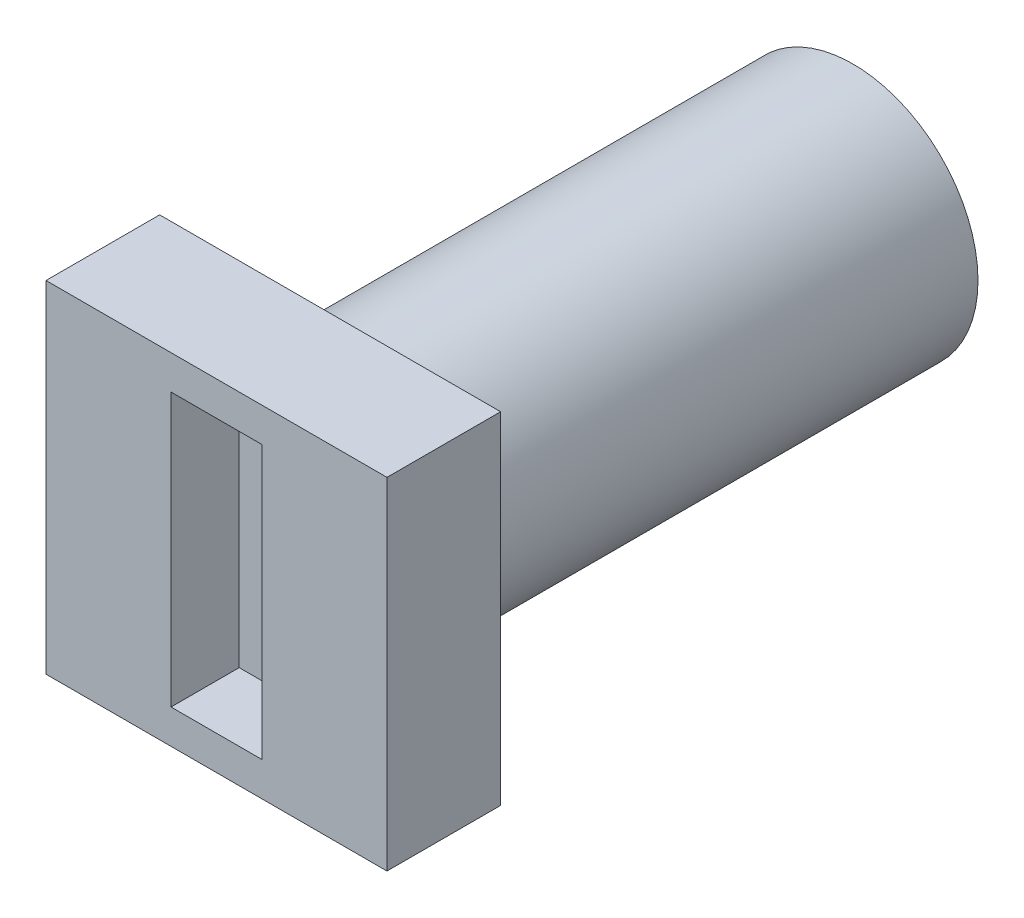
ISO-10303-21;
HEADER;
FILE_DESCRIPTION(('STEP AP214'),'2;1');
FILE_NAME('part.step','',(''),(''),'','','');
FILE_SCHEMA(('AUTOMOTIVE_DESIGN { 1 0 10303 214 1 1 1 1 }'));
ENDSEC;
DATA;
#1=APPLICATION_CONTEXT('core data for automotive mechanical design processes');
#2=APPLICATION_PROTOCOL_DEFINITION('international standard','automotive_design',2000,#1);
#3=PRODUCT_CONTEXT('',#1,'mechanical');
#4=PRODUCT('Part','Part','',(#3));
#5=PRODUCT_RELATED_PRODUCT_CATEGORY('part','',(#4));
#6=PRODUCT_DEFINITION_FORMATION('','',#4);
#7=PRODUCT_DEFINITION_CONTEXT('part definition',#1,'design');
#8=PRODUCT_DEFINITION('design','',#6,#7);
#9=PRODUCT_DEFINITION_SHAPE('','',#8);
#10=(LENGTH_UNIT() NAMED_UNIT(*) SI_UNIT(.MILLI.,.METRE.));
#11=(NAMED_UNIT(*) PLANE_ANGLE_UNIT() SI_UNIT($,.RADIAN.));
#12=(NAMED_UNIT(*) SI_UNIT($,.STERADIAN.) SOLID_ANGLE_UNIT());
#13=UNCERTAINTY_MEASURE_WITH_UNIT(LENGTH_MEASURE(1.E-05),#10,'distance_accuracy_value','');
#14=(GEOMETRIC_REPRESENTATION_CONTEXT(3) GLOBAL_UNCERTAINTY_ASSIGNED_CONTEXT((#13)) GLOBAL_UNIT_ASSIGNED_CONTEXT((#10,
#11,#12)) REPRESENTATION_CONTEXT('',''));
#15=CARTESIAN_POINT('',(0.,0.,0.));
#16=DIRECTION('',(0.,0.,1.));
#17=DIRECTION('',(1.,0.,0.));
#18=AXIS2_PLACEMENT_3D('',#15,#16,#17);
#19=CARTESIAN_POINT('',(0.,0.,0.));
#20=DIRECTION('',(0.,0.,-1.));
#21=DIRECTION('',(-1.,0.,0.));
#22=AXIS2_PLACEMENT_3D('',#19,#20,#21);
#23=PLANE('',#22);
#24=CARTESIAN_POINT('',(0.,0.,0.));
#25=DIRECTION('',(0.,0.,1.));
#26=DIRECTION('',(-1.,0.,0.));
#27=AXIS2_PLACEMENT_3D('',#24,#25,#26);
#28=CIRCLE('',#27,5.5);
#29=CARTESIAN_POINT('',(-5.,-2.29128784747792,0.));
#30=VERTEX_POINT('',#29);
#31=CARTESIAN_POINT('',(-5.,2.29128784747792,0.));
#32=VERTEX_POINT('',#31);
#33=EDGE_CURVE('E220',#30,#32,#28,.T.);
#34=ORIENTED_EDGE('',*,*,#33,.F.);
#35=DIRECTION('',(0.,-1.,0.));
#36=VECTOR('',#35,1.);
#37=CARTESIAN_POINT('',(-5.,2.29128784747792,0.));
#38=LINE('',#37,#36);
#39=EDGE_CURVE('E225',#32,#30,#38,.T.);
#40=ORIENTED_EDGE('',*,*,#39,.F.);
#41=EDGE_LOOP('',(#34,#40));
#42=FACE_BOUND('',#41,.T.);
#43=DIRECTION('',(0.,-1.,0.));
#44=VECTOR('',#43,1.);
#45=CARTESIAN_POINT('',(-2.,1.5,0.));
#46=LINE('',#45,#44);
#47=CARTESIAN_POINT('',(-2.,1.5,0.));
#48=VERTEX_POINT('',#47);
#49=CARTESIAN_POINT('',(-2.,-1.5,0.));
#50=VERTEX_POINT('',#49);
#51=EDGE_CURVE('E207',#48,#50,#46,.T.);
#52=ORIENTED_EDGE('',*,*,#51,.T.);
#53=CARTESIAN_POINT('',(0.,0.,0.));
#54=DIRECTION('',(0.,0.,1.));
#55=DIRECTION('',(-1.,0.,0.));
#56=AXIS2_PLACEMENT_3D('',#53,#54,#55);
#57=CIRCLE('',#56,2.5);
#58=EDGE_CURVE('E202',#50,#48,#57,.T.);
#59=ORIENTED_EDGE('',*,*,#58,.T.);
#60=EDGE_LOOP('',(#52,#59));
#61=FACE_BOUND('',#60,.T.);
#62=ADVANCED_FACE('F33',(#42,#61),#23,.T.);
#63=CARTESIAN_POINT('',(0.,0.,23.));
#64=DIRECTION('',(0.,0.,-1.));
#65=DIRECTION('',(-1.,0.,0.));
#66=AXIS2_PLACEMENT_3D('',#63,#64,#65);
#67=CYLINDRICAL_SURFACE('',#66,5.5);
#68=ORIENTED_EDGE('',*,*,#33,.T.);
#69=DIRECTION('',(0.,0.,-1.));
#70=VECTOR('',#69,1.);
#71=CARTESIAN_POINT('',(-5.,2.29128784747792,23.));
#72=LINE('',#71,#70);
#73=CARTESIAN_POINT('',(-5.,2.29128784747792,23.));
#74=VERTEX_POINT('',#73);
#75=EDGE_CURVE('E11',#74,#32,#72,.T.);
#76=ORIENTED_EDGE('',*,*,#75,.F.);
#77=CARTESIAN_POINT('',(0.,0.,23.));
#78=DIRECTION('',(0.,0.,1.));
#79=DIRECTION('',(-1.,0.,0.));
#80=AXIS2_PLACEMENT_3D('',#77,#78,#79);
#81=CIRCLE('',#80,5.5);
#82=CARTESIAN_POINT('',(-5.,-2.29128784747792,23.));
#83=VERTEX_POINT('',#82);
#84=EDGE_CURVE('E221',#83,#74,#81,.T.);
#85=ORIENTED_EDGE('',*,*,#84,.F.);
#86=DIRECTION('',(0.,0.,-1.));
#87=VECTOR('',#86,1.);
#88=CARTESIAN_POINT('',(-5.,-2.29128784747792,23.));
#89=LINE('',#88,#87);
#90=EDGE_CURVE('E41',#83,#30,#89,.T.);
#91=ORIENTED_EDGE('',*,*,#90,.T.);
#92=EDGE_LOOP('',(#68,#76,#85,#91));
#93=FACE_BOUND('',#92,.T.);
#94=ADVANCED_FACE('F35',(#93),#67,.T.);
#95=CARTESIAN_POINT('',(-5.,2.29128784747792,23.));
#96=DIRECTION('',(1.,0.,0.));
#97=DIRECTION('',(0.,0.,-1.));
#98=AXIS2_PLACEMENT_3D('',#95,#96,#97);
#99=PLANE('',#98);
#100=CARTESIAN_POINT('',(-5.,-0.00128784747791726,3.5));
#101=DIRECTION('',(-1.,0.,0.));
#102=DIRECTION('',(0.,0.,1.));
#103=AXIS2_PLACEMENT_3D('',#100,#101,#102);
#104=CIRCLE('',#103,1.);
#105=CARTESIAN_POINT('',(-5.,-0.00128784747791726,4.5));
#106=VERTEX_POINT('',#105);
#107=EDGE_CURVE('E190',#106,#106,#104,.T.);
#108=ORIENTED_EDGE('',*,*,#107,.F.);
#109=EDGE_LOOP('',(#108));
#110=FACE_BOUND('',#109,.T.);
#111=CARTESIAN_POINT('',(-5.,-0.00128784747791726,11.5));
#112=DIRECTION('',(-1.,0.,0.));
#113=DIRECTION('',(0.,0.,1.));
#114=AXIS2_PLACEMENT_3D('',#111,#112,#113);
#115=CIRCLE('',#114,1.);
#116=CARTESIAN_POINT('',(-5.,-0.00128784747791726,12.5));
#117=VERTEX_POINT('',#116);
#118=EDGE_CURVE('E196',#117,#117,#115,.T.);
#119=ORIENTED_EDGE('',*,*,#118,.F.);
#120=EDGE_LOOP('',(#119));
#121=FACE_BOUND('',#120,.T.);
#122=ORIENTED_EDGE('',*,*,#39,.T.);
#123=ORIENTED_EDGE('',*,*,#90,.F.);
#124=DIRECTION('',(0.,-1.,0.));
#125=VECTOR('',#124,1.);
#126=CARTESIAN_POINT('',(-5.,2.29128784747792,23.));
#127=LINE('',#126,#125);
#128=EDGE_CURVE('E224',#74,#83,#127,.T.);
#129=ORIENTED_EDGE('',*,*,#128,.F.);
#130=ORIENTED_EDGE('',*,*,#75,.T.);
#131=EDGE_LOOP('',(#122,#123,#129,#130));
#132=FACE_BOUND('',#131,.T.);
#133=ADVANCED_FACE('F238',(#110,#121,#132),#99,.F.);
#134=CARTESIAN_POINT('',(0.,0.,23.));
#135=DIRECTION('',(0.,0.,-1.));
#136=DIRECTION('',(-1.,0.,0.));
#137=AXIS2_PLACEMENT_3D('',#134,#135,#136);
#138=CYLINDRICAL_SURFACE('',#137,2.5);
#139=ORIENTED_EDGE('',*,*,#58,.F.);
#140=DIRECTION('',(0.,0.,-1.));
#141=VECTOR('',#140,1.);
#142=CARTESIAN_POINT('',(-2.,-1.5,23.));
#143=LINE('',#142,#141);
#144=CARTESIAN_POINT('',(-2.,-1.5,23.));
#145=VERTEX_POINT('',#144);
#146=EDGE_CURVE('E210',#145,#50,#143,.T.);
#147=ORIENTED_EDGE('',*,*,#146,.F.);
#148=CARTESIAN_POINT('',(0.,0.,23.));
#149=DIRECTION('',(0.,0.,1.));
#150=DIRECTION('',(-1.,0.,0.));
#151=AXIS2_PLACEMENT_3D('',#148,#149,#150);
#152=CIRCLE('',#151,2.5);
#153=CARTESIAN_POINT('',(-2.,1.5,23.));
#154=VERTEX_POINT('',#153);
#155=EDGE_CURVE('E203',#145,#154,#152,.T.);
#156=ORIENTED_EDGE('',*,*,#155,.T.);
#157=DIRECTION('',(0.,0.,-1.));
#158=VECTOR('',#157,1.);
#159=CARTESIAN_POINT('',(-2.,1.5,23.));
#160=LINE('',#159,#158);
#161=EDGE_CURVE('E217',#154,#48,#160,.T.);
#162=ORIENTED_EDGE('',*,*,#161,.T.);
#163=EDGE_LOOP('',(#139,#147,#156,#162));
#164=FACE_BOUND('',#163,.T.);
#165=ADVANCED_FACE('F264',(#164),#138,.F.);
#166=CARTESIAN_POINT('',(-2.,1.5,23.));
#167=DIRECTION('',(1.,0.,0.));
#168=DIRECTION('',(0.,0.,-1.));
#169=AXIS2_PLACEMENT_3D('',#166,#167,#168);
#170=PLANE('',#169);
#171=CARTESIAN_POINT('',(-2.,-0.00128784747791726,3.5));
#172=DIRECTION('',(1.,0.,0.));
#173=DIRECTION('',(0.,0.,-1.));
#174=AXIS2_PLACEMENT_3D('',#171,#172,#173);
#175=CIRCLE('',#174,0.999999999999999);
#176=CARTESIAN_POINT('',(-2.,-0.00128784747791726,2.5));
#177=VERTEX_POINT('',#176);
#178=EDGE_CURVE('E193',#177,#177,#175,.T.);
#179=ORIENTED_EDGE('',*,*,#178,.F.);
#180=EDGE_LOOP('',(#179));
#181=FACE_BOUND('',#180,.T.);
#182=CARTESIAN_POINT('',(-2.,-0.00128784747791726,11.5));
#183=DIRECTION('',(1.,0.,0.));
#184=DIRECTION('',(0.,0.,-1.));
#185=AXIS2_PLACEMENT_3D('',#182,#183,#184);
#186=CIRCLE('',#185,0.999999999999999);
#187=CARTESIAN_POINT('',(-2.,-0.00128784747791726,10.5));
#188=VERTEX_POINT('',#187);
#189=EDGE_CURVE('E199',#188,#188,#186,.T.);
#190=ORIENTED_EDGE('',*,*,#189,.F.);
#191=EDGE_LOOP('',(#190));
#192=FACE_BOUND('',#191,.T.);
#193=ORIENTED_EDGE('',*,*,#51,.F.);
#194=ORIENTED_EDGE('',*,*,#161,.F.);
#195=DIRECTION('',(0.,-1.,0.));
#196=VECTOR('',#195,1.);
#197=CARTESIAN_POINT('',(-2.,1.5,23.));
#198=LINE('',#197,#196);
#199=EDGE_CURVE('E206',#154,#145,#198,.T.);
#200=ORIENTED_EDGE('',*,*,#199,.T.);
#201=ORIENTED_EDGE('',*,*,#146,.T.);
#202=EDGE_LOOP('',(#193,#194,#200,#201));
#203=FACE_BOUND('',#202,.T.);
#204=ADVANCED_FACE('F271',(#181,#192,#203),#170,.T.);
#205=CARTESIAN_POINT('',(-5.,-0.00128784747791726,11.5));
#206=DIRECTION('',(-1.,0.,0.));
#207=DIRECTION('',(0.,0.,1.));
#208=AXIS2_PLACEMENT_3D('',#205,#206,#207);
#209=CYLINDRICAL_SURFACE('',#208,0.999999999999999);
#210=ORIENTED_EDGE('',*,*,#118,.T.);
#211=EDGE_LOOP('',(#210));
#212=FACE_BOUND('',#211,.T.);
#213=ORIENTED_EDGE('',*,*,#189,.T.);
#214=EDGE_LOOP('',(#213));
#215=FACE_BOUND('',#214,.T.);
#216=ADVANCED_FACE('F277',(#212,#215),#209,.F.);
#217=CARTESIAN_POINT('',(-5.,-0.00128784747791726,3.5));
#218=DIRECTION('',(-1.,0.,0.));
#219=DIRECTION('',(0.,0.,1.));
#220=AXIS2_PLACEMENT_3D('',#217,#218,#219);
#221=CYLINDRICAL_SURFACE('',#220,0.999999999999999);
#222=ORIENTED_EDGE('',*,*,#107,.T.);
#223=EDGE_LOOP('',(#222));
#224=FACE_BOUND('',#223,.T.);
#225=ORIENTED_EDGE('',*,*,#178,.T.);
#226=EDGE_LOOP('',(#225));
#227=FACE_BOUND('',#226,.T.);
#228=ADVANCED_FACE('F253',(#224,#227),#221,.F.);
#229=CARTESIAN_POINT('',(0.,0.,23.));
#230=DIRECTION('',(0.,0.,1.));
#231=DIRECTION('',(1.,0.,0.));
#232=AXIS2_PLACEMENT_3D('',#229,#230,#231);
#233=PLANE('',#232);
#234=ORIENTED_EDGE('',*,*,#155,.F.);
#235=ORIENTED_EDGE('',*,*,#199,.F.);
#236=EDGE_LOOP('',(#234,#235));
#237=FACE_BOUND('',#236,.T.);
#238=ADVANCED_FACE('F243',(#237),#233,.F.);
#239=DIRECTION('',(0.,-1.,0.));
#240=VECTOR('',#239,1.);
#241=CARTESIAN_POINT('',(-7.5,7.5,23.));
#242=LINE('',#241,#240);
#243=CARTESIAN_POINT('',(-7.5,7.5,23.));
#244=VERTEX_POINT('',#243);
#245=CARTESIAN_POINT('',(-7.5,-7.5,23.));
#246=VERTEX_POINT('',#245);
#247=EDGE_CURVE('E169',#244,#246,#242,.T.);
#248=ORIENTED_EDGE('',*,*,#247,.F.);
#249=DIRECTION('',(-1.,0.,0.));
#250=VECTOR('',#249,1.);
#251=CARTESIAN_POINT('',(-7.5,7.5,23.));
#252=LINE('',#251,#250);
#253=CARTESIAN_POINT('',(7.5,7.5,23.));
#254=VERTEX_POINT('',#253);
#255=EDGE_CURVE('E176',#254,#244,#252,.T.);
#256=ORIENTED_EDGE('',*,*,#255,.F.);
#257=DIRECTION('',(0.,1.,0.));
#258=VECTOR('',#257,1.);
#259=CARTESIAN_POINT('',(7.5,7.5,23.));
#260=LINE('',#259,#258);
#261=CARTESIAN_POINT('',(7.5,-7.5,23.));
#262=VERTEX_POINT('',#261);
#263=EDGE_CURVE('E174',#262,#254,#260,.T.);
#264=ORIENTED_EDGE('',*,*,#263,.F.);
#265=DIRECTION('',(1.,0.,0.));
#266=VECTOR('',#265,1.);
#267=CARTESIAN_POINT('',(-7.5,-7.5,23.));
#268=LINE('',#267,#266);
#269=EDGE_CURVE('E172',#246,#262,#268,.T.);
#270=ORIENTED_EDGE('',*,*,#269,.F.);
#271=EDGE_LOOP('',(#248,#256,#264,#270));
#272=FACE_BOUND('',#271,.T.);
#273=ORIENTED_EDGE('',*,*,#128,.T.);
#274=ORIENTED_EDGE('',*,*,#84,.T.);
#275=EDGE_LOOP('',(#273,#274));
#276=FACE_BOUND('',#275,.T.);
#277=ADVANCED_FACE('F240',(#272,#276),#233,.F.);
#278=CARTESIAN_POINT('',(-7.5,7.5,25.));
#279=DIRECTION('',(1.,0.,0.));
#280=DIRECTION('',(0.,1.,0.));
#281=AXIS2_PLACEMENT_3D('',#278,#279,#280);
#282=PLANE('',#281);
#283=ORIENTED_EDGE('',*,*,#247,.T.);
#284=DIRECTION('',(0.,0.,-1.));
#285=VECTOR('',#284,1.);
#286=CARTESIAN_POINT('',(-7.5,-7.5,25.));
#287=LINE('',#286,#285);
#288=CARTESIAN_POINT('',(-7.5,-7.5,28.));
#289=VERTEX_POINT('',#288);
#290=EDGE_CURVE('E187',#289,#246,#287,.T.);
#291=ORIENTED_EDGE('',*,*,#290,.F.);
#292=DIRECTION('',(0.,-1.,0.));
#293=VECTOR('',#292,1.);
#294=CARTESIAN_POINT('',(-7.5,7.5,28.));
#295=LINE('',#294,#293);
#296=CARTESIAN_POINT('',(-7.5,7.5,28.));
#297=VERTEX_POINT('',#296);
#298=EDGE_CURVE('E136',#297,#289,#295,.T.);
#299=ORIENTED_EDGE('',*,*,#298,.F.);
#300=DIRECTION('',(0.,0.,-1.));
#301=VECTOR('',#300,1.);
#302=CARTESIAN_POINT('',(-7.5,7.5,25.));
#303=LINE('',#302,#301);
#304=EDGE_CURVE('E178',#297,#244,#303,.T.);
#305=ORIENTED_EDGE('',*,*,#304,.T.);
#306=EDGE_LOOP('',(#283,#291,#299,#305));
#307=FACE_BOUND('',#306,.T.);
#308=ADVANCED_FACE('F242',(#307),#282,.F.);
#309=CARTESIAN_POINT('',(-7.5,-7.5,25.));
#310=DIRECTION('',(0.,1.,0.));
#311=DIRECTION('',(0.,0.,1.));
#312=AXIS2_PLACEMENT_3D('',#309,#310,#311);
#313=PLANE('',#312);
#314=ORIENTED_EDGE('',*,*,#269,.T.);
#315=DIRECTION('',(0.,0.,-1.));
#316=VECTOR('',#315,1.);
#317=CARTESIAN_POINT('',(7.5,-7.5,25.));
#318=LINE('',#317,#316);
#319=CARTESIAN_POINT('',(7.5,-7.5,28.));
#320=VERTEX_POINT('',#319);
#321=EDGE_CURVE('E184',#320,#262,#318,.T.);
#322=ORIENTED_EDGE('',*,*,#321,.F.);
#323=DIRECTION('',(1.,0.,0.));
#324=VECTOR('',#323,1.);
#325=CARTESIAN_POINT('',(-7.5,-7.5,28.));
#326=LINE('',#325,#324);
#327=EDGE_CURVE('E160',#289,#320,#326,.T.);
#328=ORIENTED_EDGE('',*,*,#327,.F.);
#329=ORIENTED_EDGE('',*,*,#290,.T.);
#330=EDGE_LOOP('',(#314,#322,#328,#329));
#331=FACE_BOUND('',#330,.T.);
#332=ADVANCED_FACE('F250',(#331),#313,.F.);
#333=CARTESIAN_POINT('',(7.5,7.5,25.));
#334=DIRECTION('',(-1.,0.,0.));
#335=DIRECTION('',(0.,-1.,0.));
#336=AXIS2_PLACEMENT_3D('',#333,#334,#335);
#337=PLANE('',#336);
#338=ORIENTED_EDGE('',*,*,#263,.T.);
#339=DIRECTION('',(0.,0.,-1.));
#340=VECTOR('',#339,1.);
#341=CARTESIAN_POINT('',(7.5,7.5,25.));
#342=LINE('',#341,#340);
#343=CARTESIAN_POINT('',(7.5,7.5,28.));
#344=VERTEX_POINT('',#343);
#345=EDGE_CURVE('E181',#344,#254,#342,.T.);
#346=ORIENTED_EDGE('',*,*,#345,.F.);
#347=DIRECTION('',(0.,1.,0.));
#348=VECTOR('',#347,1.);
#349=CARTESIAN_POINT('',(7.5,7.5,28.));
#350=LINE('',#349,#348);
#351=EDGE_CURVE('E163',#320,#344,#350,.T.);
#352=ORIENTED_EDGE('',*,*,#351,.F.);
#353=ORIENTED_EDGE('',*,*,#321,.T.);
#354=EDGE_LOOP('',(#338,#346,#352,#353));
#355=FACE_BOUND('',#354,.T.);
#356=ADVANCED_FACE('F297',(#355),#337,.F.);
#357=CARTESIAN_POINT('',(-7.5,7.5,25.));
#358=DIRECTION('',(0.,-1.,0.));
#359=DIRECTION('',(0.,0.,-1.));
#360=AXIS2_PLACEMENT_3D('',#357,#358,#359);
#361=PLANE('',#360);
#362=ORIENTED_EDGE('',*,*,#255,.T.);
#363=ORIENTED_EDGE('',*,*,#304,.F.);
#364=DIRECTION('',(-1.,0.,0.));
#365=VECTOR('',#364,1.);
#366=CARTESIAN_POINT('',(-7.5,7.5,28.));
#367=LINE('',#366,#365);
#368=EDGE_CURVE('E166',#344,#297,#367,.T.);
#369=ORIENTED_EDGE('',*,*,#368,.F.);
#370=ORIENTED_EDGE('',*,*,#345,.T.);
#371=EDGE_LOOP('',(#362,#363,#369,#370));
#372=FACE_BOUND('',#371,.T.);
#373=ADVANCED_FACE('F300',(#372),#361,.F.);
#374=CARTESIAN_POINT('',(0.,0.,28.));
#375=DIRECTION('',(0.,0.,1.));
#376=DIRECTION('',(1.,0.,0.));
#377=AXIS2_PLACEMENT_3D('',#374,#375,#376);
#378=PLANE('',#377);
#379=ORIENTED_EDGE('',*,*,#298,.T.);
#380=ORIENTED_EDGE('',*,*,#327,.T.);
#381=ORIENTED_EDGE('',*,*,#351,.T.);
#382=ORIENTED_EDGE('',*,*,#368,.T.);
#383=EDGE_LOOP('',(#379,#380,#381,#382));
#384=FACE_BOUND('',#383,.T.);
#385=DIRECTION('',(1.,0.,0.));
#386=VECTOR('',#385,1.);
#387=CARTESIAN_POINT('',(-2.,-6.,28.));
#388=LINE('',#387,#386);
#389=CARTESIAN_POINT('',(-2.,-6.,28.));
#390=VERTEX_POINT('',#389);
#391=CARTESIAN_POINT('',(2.,-6.,28.));
#392=VERTEX_POINT('',#391);
#393=EDGE_CURVE('E130',#390,#392,#388,.T.);
#394=ORIENTED_EDGE('',*,*,#393,.F.);
#395=DIRECTION('',(0.,-1.,0.));
#396=VECTOR('',#395,1.);
#397=CARTESIAN_POINT('',(-2.,6.,28.));
#398=LINE('',#397,#396);
#399=CARTESIAN_POINT('',(-2.,6.,28.));
#400=VERTEX_POINT('',#399);
#401=EDGE_CURVE('E121',#400,#390,#398,.T.);
#402=ORIENTED_EDGE('',*,*,#401,.F.);
#403=DIRECTION('',(-1.,0.,0.));
#404=VECTOR('',#403,1.);
#405=CARTESIAN_POINT('',(-2.,6.,28.));
#406=LINE('',#405,#404);
#407=CARTESIAN_POINT('',(2.,6.,28.));
#408=VERTEX_POINT('',#407);
#409=EDGE_CURVE('E144',#408,#400,#406,.T.);
#410=ORIENTED_EDGE('',*,*,#409,.F.);
#411=DIRECTION('',(0.,1.,0.));
#412=VECTOR('',#411,1.);
#413=CARTESIAN_POINT('',(2.,6.,28.));
#414=LINE('',#413,#412);
#415=EDGE_CURVE('E142',#392,#408,#414,.T.);
#416=ORIENTED_EDGE('',*,*,#415,.F.);
#417=EDGE_LOOP('',(#394,#402,#410,#416));
#418=FACE_BOUND('',#417,.T.);
#419=ADVANCED_FACE('F140',(#384,#418),#378,.T.);
#420=CARTESIAN_POINT('',(-2.,6.,28.));
#421=DIRECTION('',(1.,0.,0.));
#422=DIRECTION('',(0.,1.,0.));
#423=AXIS2_PLACEMENT_3D('',#420,#421,#422);
#424=PLANE('',#423);
#425=DIRECTION('',(0.,-1.,0.));
#426=VECTOR('',#425,1.);
#427=CARTESIAN_POINT('',(-2.,6.,25.));
#428=LINE('',#427,#426);
#429=CARTESIAN_POINT('',(-2.,6.,25.));
#430=VERTEX_POINT('',#429);
#431=CARTESIAN_POINT('',(-2.,-6.,25.));
#432=VERTEX_POINT('',#431);
#433=EDGE_CURVE('E48',#430,#432,#428,.T.);
#434=ORIENTED_EDGE('',*,*,#433,.F.);
#435=DIRECTION('',(0.,0.,-1.));
#436=VECTOR('',#435,1.);
#437=CARTESIAN_POINT('',(-2.,6.,28.));
#438=LINE('',#437,#436);
#439=EDGE_CURVE('E126',#400,#430,#438,.T.);
#440=ORIENTED_EDGE('',*,*,#439,.F.);
#441=ORIENTED_EDGE('',*,*,#401,.T.);
#442=DIRECTION('',(0.,0.,-1.));
#443=VECTOR('',#442,1.);
#444=CARTESIAN_POINT('',(-2.,-6.,28.));
#445=LINE('',#444,#443);
#446=EDGE_CURVE('E124',#390,#432,#445,.T.);
#447=ORIENTED_EDGE('',*,*,#446,.T.);
#448=EDGE_LOOP('',(#434,#440,#441,#447));
#449=FACE_BOUND('',#448,.T.);
#450=ADVANCED_FACE('F123',(#449),#424,.T.);
#451=CARTESIAN_POINT('',(-2.,-6.,28.));
#452=DIRECTION('',(0.,1.,0.));
#453=DIRECTION('',(0.,0.,1.));
#454=AXIS2_PLACEMENT_3D('',#451,#452,#453);
#455=PLANE('',#454);
#456=DIRECTION('',(1.,0.,0.));
#457=VECTOR('',#456,1.);
#458=CARTESIAN_POINT('',(-2.,-6.,25.));
#459=LINE('',#458,#457);
#460=CARTESIAN_POINT('',(2.,-6.,25.));
#461=VERTEX_POINT('',#460);
#462=EDGE_CURVE('E52',#432,#461,#459,.T.);
#463=ORIENTED_EDGE('',*,*,#462,.F.);
#464=ORIENTED_EDGE('',*,*,#446,.F.);
#465=ORIENTED_EDGE('',*,*,#393,.T.);
#466=DIRECTION('',(0.,0.,-1.));
#467=VECTOR('',#466,1.);
#468=CARTESIAN_POINT('',(2.,-6.,28.));
#469=LINE('',#468,#467);
#470=EDGE_CURVE('E137',#392,#461,#469,.T.);
#471=ORIENTED_EDGE('',*,*,#470,.T.);
#472=EDGE_LOOP('',(#463,#464,#465,#471));
#473=FACE_BOUND('',#472,.T.);
#474=ADVANCED_FACE('F134',(#473),#455,.T.);
#475=CARTESIAN_POINT('',(2.,6.,28.));
#476=DIRECTION('',(-1.,0.,0.));
#477=DIRECTION('',(0.,-1.,0.));
#478=AXIS2_PLACEMENT_3D('',#475,#476,#477);
#479=PLANE('',#478);
#480=DIRECTION('',(0.,1.,0.));
#481=VECTOR('',#480,1.);
#482=CARTESIAN_POINT('',(2.,6.,25.));
#483=LINE('',#482,#481);
#484=CARTESIAN_POINT('',(2.,6.,25.));
#485=VERTEX_POINT('',#484);
#486=EDGE_CURVE('E150',#461,#485,#483,.T.);
#487=ORIENTED_EDGE('',*,*,#486,.F.);
#488=ORIENTED_EDGE('',*,*,#470,.F.);
#489=ORIENTED_EDGE('',*,*,#415,.T.);
#490=DIRECTION('',(0.,0.,-1.));
#491=VECTOR('',#490,1.);
#492=CARTESIAN_POINT('',(2.,6.,28.));
#493=LINE('',#492,#491);
#494=EDGE_CURVE('E154',#408,#485,#493,.T.);
#495=ORIENTED_EDGE('',*,*,#494,.T.);
#496=EDGE_LOOP('',(#487,#488,#489,#495));
#497=FACE_BOUND('',#496,.T.);
#498=ADVANCED_FACE('F326',(#497),#479,.T.);
#499=CARTESIAN_POINT('',(-2.,6.,28.));
#500=DIRECTION('',(0.,-1.,0.));
#501=DIRECTION('',(0.,0.,-1.));
#502=AXIS2_PLACEMENT_3D('',#499,#500,#501);
#503=PLANE('',#502);
#504=DIRECTION('',(-1.,0.,0.));
#505=VECTOR('',#504,1.);
#506=CARTESIAN_POINT('',(-2.,6.,25.));
#507=LINE('',#506,#505);
#508=EDGE_CURVE('E131',#485,#430,#507,.T.);
#509=ORIENTED_EDGE('',*,*,#508,.F.);
#510=ORIENTED_EDGE('',*,*,#494,.F.);
#511=ORIENTED_EDGE('',*,*,#409,.T.);
#512=ORIENTED_EDGE('',*,*,#439,.T.);
#513=EDGE_LOOP('',(#509,#510,#511,#512));
#514=FACE_BOUND('',#513,.T.);
#515=ADVANCED_FACE('F322',(#514),#503,.T.);
#516=CARTESIAN_POINT('',(0.,0.,25.));
#517=DIRECTION('',(0.,0.,1.));
#518=DIRECTION('',(1.,0.,0.));
#519=AXIS2_PLACEMENT_3D('',#516,#517,#518);
#520=PLANE('',#519);
#521=ORIENTED_EDGE('',*,*,#433,.T.);
#522=ORIENTED_EDGE('',*,*,#462,.T.);
#523=ORIENTED_EDGE('',*,*,#486,.T.);
#524=ORIENTED_EDGE('',*,*,#508,.T.);
#525=EDGE_LOOP('',(#521,#522,#523,#524));
#526=FACE_BOUND('',#525,.T.);
#527=ADVANCED_FACE('F320',(#526),#520,.T.);
#528=CLOSED_SHELL('',(#62,#94,#133,#165,#204,#216,#228,#238,#277,#308,#332,#356,#373,#419,#450,
#474,#498,#515,#527));
#529=MANIFOLD_SOLID_BREP('B2',#528);
#530=ADVANCED_BREP_SHAPE_REPRESENTATION('',(#18,#529),#14);
#531=SHAPE_DEFINITION_REPRESENTATION(#9,#530);
ENDSEC;
END-ISO-10303-21;
